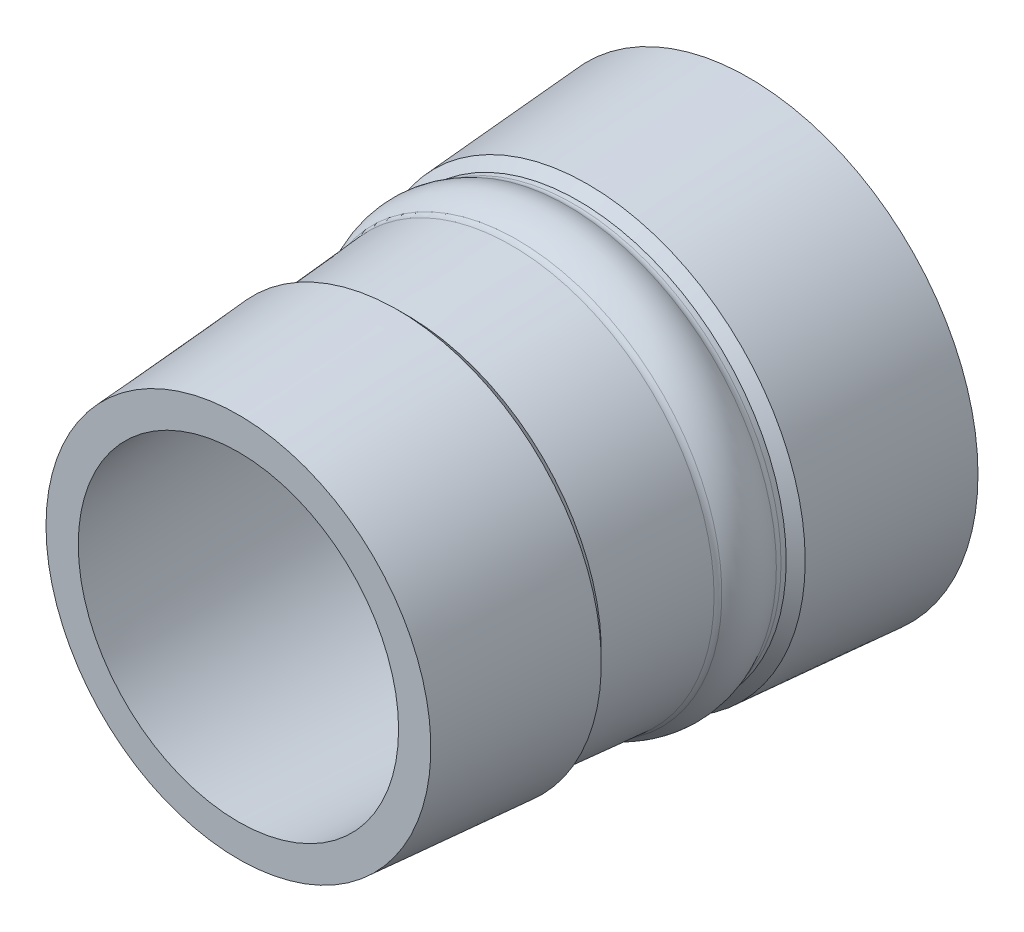
ISO-10303-21;
HEADER;
FILE_DESCRIPTION(('STEP AP214'),'2;1');
FILE_NAME('part.step','',(''),(''),'','','');
FILE_SCHEMA(('AUTOMOTIVE_DESIGN { 1 0 10303 214 1 1 1 1 }'));
ENDSEC;
DATA;
#1=APPLICATION_CONTEXT('core data for automotive mechanical design processes');
#2=APPLICATION_PROTOCOL_DEFINITION('international standard','automotive_design',2000,#1);
#3=PRODUCT_CONTEXT('',#1,'mechanical');
#4=PRODUCT('Part','Part','',(#3));
#5=PRODUCT_RELATED_PRODUCT_CATEGORY('part','',(#4));
#6=PRODUCT_DEFINITION_FORMATION('','',#4);
#7=PRODUCT_DEFINITION_CONTEXT('part definition',#1,'design');
#8=PRODUCT_DEFINITION('design','',#6,#7);
#9=PRODUCT_DEFINITION_SHAPE('','',#8);
#10=(LENGTH_UNIT() NAMED_UNIT(*) SI_UNIT(.MILLI.,.METRE.));
#11=(NAMED_UNIT(*) PLANE_ANGLE_UNIT() SI_UNIT($,.RADIAN.));
#12=(NAMED_UNIT(*) SI_UNIT($,.STERADIAN.) SOLID_ANGLE_UNIT());
#13=UNCERTAINTY_MEASURE_WITH_UNIT(LENGTH_MEASURE(1.E-05),#10,'distance_accuracy_value','');
#14=(GEOMETRIC_REPRESENTATION_CONTEXT(3) GLOBAL_UNCERTAINTY_ASSIGNED_CONTEXT((#13)) GLOBAL_UNIT_ASSIGNED_CONTEXT((#10,
#11,#12)) REPRESENTATION_CONTEXT('',''));
#15=CARTESIAN_POINT('',(0.,0.,0.));
#16=DIRECTION('',(0.,0.,1.));
#17=DIRECTION('',(1.,0.,0.));
#18=AXIS2_PLACEMENT_3D('',#15,#16,#17);
#19=CARTESIAN_POINT('',(224.138955783126,884.647735582405,21.2777495189972));
#20=DIRECTION('',(0.,0.,1.));
#21=DIRECTION('',(1.,0.,0.));
#22=AXIS2_PLACEMENT_3D('',#19,#20,#21);
#23=TOROIDAL_SURFACE('',#22,17.7795195869481,1.);
#24=CARTESIAN_POINT('',(224.138955783126,884.647735582405,21.2063532390037));
#25=DIRECTION('',(0.,0.,-1.));
#26=DIRECTION('',(-1.,0.,0.));
#27=AXIS2_PLACEMENT_3D('',#24,#25,#26);
#28=CIRCLE('',#27,16.7820715576239);
#29=CARTESIAN_POINT('',(207.356884225502,884.647735582405,21.2063532390038));
#30=VERTEX_POINT('',#29);
#31=EDGE_CURVE('E133',#30,#30,#28,.T.);
#32=ORIENTED_EDGE('',*,*,#31,.F.);
#33=EDGE_LOOP('',(#32));
#34=FACE_BOUND('',#33,.T.);
#35=CARTESIAN_POINT('',(224.138955783126,884.647735582405,20.5523804719924));
#36=DIRECTION('',(0.,0.,1.));
#37=DIRECTION('',(-1.,0.,0.));
#38=AXIS2_PLACEMENT_3D('',#35,#36,#37);
#39=CIRCLE('',#38,17.0911594009643);
#40=CARTESIAN_POINT('',(207.047796382161,884.647735582405,20.5523804719924));
#41=VERTEX_POINT('',#40);
#42=EDGE_CURVE('E132',#41,#41,#39,.T.);
#43=ORIENTED_EDGE('',*,*,#42,.F.);
#44=EDGE_LOOP('',(#43));
#45=FACE_BOUND('',#44,.T.);
#46=ADVANCED_FACE('F42',(#34,#45),#23,.T.);
#47=CARTESIAN_POINT('',(224.138955783126,884.647735582405,16.9325723414777));
#48=DIRECTION('',(0.,0.,1.));
#49=DIRECTION('',(1.,0.,0.));
#50=AXIS2_PLACEMENT_3D('',#47,#48,#49);
#51=TOROIDAL_SURFACE('',#50,18.0905427954495,1.);
#52=CARTESIAN_POINT('',(224.138955783126,884.647735582405,17.5525044813149));
#53=DIRECTION('',(0.,0.,-1.));
#54=DIRECTION('',(1.,0.,0.));
#55=AXIS2_PLACEMENT_3D('',#52,#53,#54);
#56=CIRCLE('',#55,17.3058873666164);
#57=CARTESIAN_POINT('',(241.444843149742,884.647735582405,17.5525044813149));
#58=VERTEX_POINT('',#57);
#59=EDGE_CURVE('E129',#58,#58,#56,.T.);
#60=ORIENTED_EDGE('',*,*,#59,.F.);
#61=EDGE_LOOP('',(#60));
#62=FACE_BOUND('',#61,.T.);
#63=CARTESIAN_POINT('',(224.138955783126,884.647735582405,16.8611760614839));
#64=DIRECTION('',(0.,0.,1.));
#65=DIRECTION('',(-1.,0.,0.));
#66=AXIS2_PLACEMENT_3D('',#63,#64,#65);
#67=CIRCLE('',#66,17.0930947661254);
#68=CARTESIAN_POINT('',(207.045861017,884.647735582405,16.8611760614839));
#69=VERTEX_POINT('',#68);
#70=EDGE_CURVE('E45',#69,#69,#67,.T.);
#71=ORIENTED_EDGE('',*,*,#70,.F.);
#72=EDGE_LOOP('',(#71));
#73=FACE_BOUND('',#72,.T.);
#74=ADVANCED_FACE('F164',(#62,#73),#51,.T.);
#75=CARTESIAN_POINT('',(224.138955783126,884.647735582405,22.1784700632629));
#76=DIRECTION('',(0.,0.,-1.));
#77=DIRECTION('',(-1.,0.,0.));
#78=AXIS2_PLACEMENT_3D('',#75,#76,#77);
#79=TOROIDAL_SURFACE('',#78,19.8450372019114,1.);
#80=CARTESIAN_POINT('',(224.138955783126,884.647735582405,21.5752674100011));
#81=DIRECTION('',(0.,0.,-1.));
#82=DIRECTION('',(-1.,0.,0.));
#83=AXIS2_PLACEMENT_3D('',#80,#81,#82);
#84=CIRCLE('',#83,19.0474492386759);
#85=CARTESIAN_POINT('',(205.09150654445,884.647735582405,21.5752674100011));
#86=VERTEX_POINT('',#85);
#87=EDGE_CURVE('E121',#86,#86,#84,.T.);
#88=ORIENTED_EDGE('',*,*,#87,.F.);
#89=EDGE_LOOP('',(#88));
#90=FACE_BOUND('',#89,.T.);
#91=CARTESIAN_POINT('',(224.138955783126,884.647735582405,22.0991992897073));
#92=DIRECTION('',(0.,0.,1.));
#93=DIRECTION('',(1.,0.,0.));
#94=AXIS2_PLACEMENT_3D('',#91,#92,#93);
#95=CIRCLE('',#94,18.8481840811059);
#96=CARTESIAN_POINT('',(242.987139864231,884.647735582405,22.0991992897072));
#97=VERTEX_POINT('',#96);
#98=EDGE_CURVE('E124',#97,#97,#95,.T.);
#99=ORIENTED_EDGE('',*,*,#98,.F.);
#100=EDGE_LOOP('',(#99));
#101=FACE_BOUND('',#100,.T.);
#102=ADVANCED_FACE('F114',(#90,#101),#79,.F.);
#103=CARTESIAN_POINT('',(224.138955783126,884.647735582405,16.4098870339303));
#104=DIRECTION('',(0.,0.,-1.));
#105=DIRECTION('',(-1.,0.,0.));
#106=AXIS2_PLACEMENT_3D('',#103,#104,#105);
#107=TOROIDAL_SURFACE('',#106,20.3037607886776,1.);
#108=CARTESIAN_POINT('',(224.138955783126,884.647735582405,16.3306162603746));
#109=DIRECTION('',(0.,0.,-1.));
#110=DIRECTION('',(-1.,0.,0.));
#111=AXIS2_PLACEMENT_3D('',#108,#109,#110);
#112=CIRCLE('',#111,19.3069076678722);
#113=CARTESIAN_POINT('',(204.832048115253,884.647735582405,16.3306162603746));
#114=VERTEX_POINT('',#113);
#115=EDGE_CURVE('E91',#114,#114,#112,.T.);
#116=ORIENTED_EDGE('',*,*,#115,.F.);
#117=EDGE_LOOP('',(#116));
#118=FACE_BOUND('',#117,.T.);
#119=CARTESIAN_POINT('',(224.138955783126,884.647735582405,16.8794559063593));
#120=DIRECTION('',(0.,0.,1.));
#121=DIRECTION('',(1.,0.,0.));
#122=AXIS2_PLACEMENT_3D('',#119,#120,#121);
#123=CIRCLE('',#122,19.4208649431523);
#124=CARTESIAN_POINT('',(243.559820726278,884.647735582405,16.8794559063593));
#125=VERTEX_POINT('',#124);
#126=EDGE_CURVE('E93',#125,#125,#123,.T.);
#127=ORIENTED_EDGE('',*,*,#126,.F.);
#128=EDGE_LOOP('',(#127));
#129=FACE_BOUND('',#128,.T.);
#130=ADVANCED_FACE('F110',(#118,#129),#107,.F.);
#131=CARTESIAN_POINT('',(224.138955783126,884.647735582405,47.5));
#132=DIRECTION('',(0.,0.,-1.));
#133=DIRECTION('',(-1.,0.,0.));
#134=AXIS2_PLACEMENT_3D('',#131,#132,#133);
#135=CONICAL_SURFACE('',#134,17.9,0.0714570757138935);
#136=CARTESIAN_POINT('',(224.138955783126,884.647735582405,47.5));
#137=DIRECTION('',(0.,0.,-1.));
#138=DIRECTION('',(-1.,0.,0.));
#139=AXIS2_PLACEMENT_3D('',#136,#137,#138);
#140=CIRCLE('',#139,17.9);
#141=CARTESIAN_POINT('',(206.238955783126,884.647735582405,47.5));
#142=VERTEX_POINT('',#141);
#143=EDGE_CURVE('E89',#142,#142,#140,.T.);
#144=ORIENTED_EDGE('',*,*,#143,.T.);
#145=EDGE_LOOP('',(#144));
#146=FACE_BOUND('',#145,.T.);
#147=CARTESIAN_POINT('',(224.138955783126,884.647735582405,32.7));
#148=DIRECTION('',(0.,0.,-1.));
#149=DIRECTION('',(-1.,0.,0.));
#150=AXIS2_PLACEMENT_3D('',#147,#148,#149);
#151=CIRCLE('',#150,18.9593684210527);
#152=CARTESIAN_POINT('',(205.179587362073,884.647735582405,32.7));
#153=VERTEX_POINT('',#152);
#154=EDGE_CURVE('E11',#153,#153,#151,.T.);
#155=ORIENTED_EDGE('',*,*,#154,.F.);
#156=EDGE_LOOP('',(#155));
#157=FACE_BOUND('',#156,.T.);
#158=ADVANCED_FACE('F113',(#146,#157),#135,.T.);
#159=CARTESIAN_POINT('',(224.138955783126,884.647735582405,32.7));
#160=DIRECTION('',(0.,0.,1.));
#161=DIRECTION('',(1.,0.,0.));
#162=AXIS2_PLACEMENT_3D('',#159,#160,#161);
#163=CONICAL_SURFACE('',#162,18.9593684210527,0.785398162499993);
#164=ORIENTED_EDGE('',*,*,#154,.T.);
#165=EDGE_LOOP('',(#164));
#166=FACE_BOUND('',#165,.T.);
#167=CARTESIAN_POINT('',(224.138955783126,884.647735582405,31.8161165235168));
#168=DIRECTION('',(0.,0.,-1.));
#169=DIRECTION('',(-1.,0.,0.));
#170=AXIS2_PLACEMENT_3D('',#167,#168,#169);
#171=CIRCLE('',#170,18.0754849445695);
#172=CARTESIAN_POINT('',(206.063470838556,884.647735582405,31.8161165235168));
#173=VERTEX_POINT('',#172);
#174=EDGE_CURVE('E51',#173,#173,#171,.T.);
#175=ORIENTED_EDGE('',*,*,#174,.F.);
#176=EDGE_LOOP('',(#175));
#177=FACE_BOUND('',#176,.T.);
#178=ADVANCED_FACE('F217',(#166,#177),#163,.T.);
#179=CARTESIAN_POINT('',(224.138955783126,884.647735582405,21.791757775041));
#180=DIRECTION('',(0.,0.,-1.));
#181=DIRECTION('',(-1.,0.,0.));
#182=AXIS2_PLACEMENT_3D('',#179,#180,#181);
#183=CONICAL_SURFACE('',#182,18.8726321428936,0.0793540301231868);
#184=ORIENTED_EDGE('',*,*,#174,.T.);
#185=EDGE_LOOP('',(#184));
#186=FACE_BOUND('',#185,.T.);
#187=ORIENTED_EDGE('',*,*,#98,.T.);
#188=EDGE_LOOP('',(#187));
#189=FACE_BOUND('',#188,.T.);
#190=ADVANCED_FACE('F204',(#186,#189),#183,.T.);
#191=CARTESIAN_POINT('',(224.138955783126,884.647735582405,18.9348860329974));
#192=DIRECTION('',(0.,0.,-1.));
#193=DIRECTION('',(-1.,0.,0.));
#194=AXIS2_PLACEMENT_3D('',#191,#192,#193);
#195=TOROIDAL_SURFACE('',#194,15.5561907150907,4.37727082718614);
#196=ORIENTED_EDGE('',*,*,#87,.T.);
#197=EDGE_LOOP('',(#196));
#198=FACE_BOUND('',#197,.T.);
#199=ORIENTED_EDGE('',*,*,#126,.T.);
#200=EDGE_LOOP('',(#199));
#201=FACE_BOUND('',#200,.T.);
#202=ADVANCED_FACE('F104',(#198,#201),#195,.T.);
#203=CARTESIAN_POINT('',(224.138955783126,884.647735582405,16.638057775041));
#204=DIRECTION('',(0.,0.,-1.));
#205=DIRECTION('',(-1.,0.,0.));
#206=AXIS2_PLACEMENT_3D('',#203,#204,#205);
#207=CONICAL_SURFACE('',#206,19.2824596060844,0.0793540301232149);
#208=CARTESIAN_POINT('',(224.138955783126,884.647735582405,15.8838834764832));
#209=DIRECTION('',(0.,0.,-1.));
#210=DIRECTION('',(-1.,0.,0.));
#211=AXIS2_PLACEMENT_3D('',#208,#209,#210);
#212=CIRCLE('',#211,19.3424323129905);
#213=CARTESIAN_POINT('',(204.796523470135,884.647735582405,15.8838834764832));
#214=VERTEX_POINT('',#213);
#215=EDGE_CURVE('E84',#214,#214,#212,.T.);
#216=ORIENTED_EDGE('',*,*,#215,.F.);
#217=EDGE_LOOP('',(#216));
#218=FACE_BOUND('',#217,.T.);
#219=ORIENTED_EDGE('',*,*,#115,.T.);
#220=EDGE_LOOP('',(#219));
#221=FACE_BOUND('',#220,.T.);
#222=ADVANCED_FACE('F101',(#218,#221),#207,.T.);
#223=CARTESIAN_POINT('',(224.138955783126,884.647735582405,15.));
#224=DIRECTION('',(0.,0.,-1.));
#225=DIRECTION('',(-1.,0.,0.));
#226=AXIS2_PLACEMENT_3D('',#223,#224,#225);
#227=CONICAL_SURFACE('',#226,20.2263157894737,0.78539816250001);
#228=CARTESIAN_POINT('',(224.138955783126,884.647735582405,15.));
#229=DIRECTION('',(0.,0.,-1.));
#230=DIRECTION('',(-1.,0.,0.));
#231=AXIS2_PLACEMENT_3D('',#228,#229,#230);
#232=CIRCLE('',#231,20.2263157894737);
#233=CARTESIAN_POINT('',(203.912639993652,884.647735582405,15.));
#234=VERTEX_POINT('',#233);
#235=EDGE_CURVE('E81',#234,#234,#232,.T.);
#236=ORIENTED_EDGE('',*,*,#235,.F.);
#237=EDGE_LOOP('',(#236));
#238=FACE_BOUND('',#237,.T.);
#239=ORIENTED_EDGE('',*,*,#215,.T.);
#240=EDGE_LOOP('',(#239));
#241=FACE_BOUND('',#240,.T.);
#242=ADVANCED_FACE('F97',(#238,#241),#227,.T.);
#243=CARTESIAN_POINT('',(224.138955783126,884.647735582405,15.));
#244=DIRECTION('',(0.,0.,-1.));
#245=DIRECTION('',(-1.,0.,0.));
#246=AXIS2_PLACEMENT_3D('',#243,#244,#245);
#247=CONICAL_SURFACE('',#246,20.2263157894737,0.071457075713892);
#248=ORIENTED_EDGE('',*,*,#235,.T.);
#249=EDGE_LOOP('',(#248));
#250=FACE_BOUND('',#249,.T.);
#251=CARTESIAN_POINT('',(224.138955783126,884.647735582405,0.));
#252=DIRECTION('',(0.,0.,-1.));
#253=DIRECTION('',(-1.,0.,0.));
#254=AXIS2_PLACEMENT_3D('',#251,#252,#253);
#255=CIRCLE('',#254,21.3);
#256=CARTESIAN_POINT('',(202.838955783126,884.647735582405,0.));
#257=VERTEX_POINT('',#256);
#258=EDGE_CURVE('E77',#257,#257,#255,.T.);
#259=ORIENTED_EDGE('',*,*,#258,.F.);
#260=EDGE_LOOP('',(#259));
#261=FACE_BOUND('',#260,.T.);
#262=ADVANCED_FACE('F188',(#250,#261),#247,.T.);
#263=CARTESIAN_POINT('',(202.838955783126,884.647735582405,0.));
#264=DIRECTION('',(0.,0.,1.));
#265=DIRECTION('',(1.,0.,0.));
#266=AXIS2_PLACEMENT_3D('',#263,#264,#265);
#267=PLANE('',#266);
#268=ORIENTED_EDGE('',*,*,#258,.T.);
#269=EDGE_LOOP('',(#268));
#270=FACE_BOUND('',#269,.T.);
#271=CARTESIAN_POINT('',(224.138955783126,884.647735582405,0.));
#272=DIRECTION('',(0.,0.,-1.));
#273=DIRECTION('',(-1.,0.,0.));
#274=AXIS2_PLACEMENT_3D('',#271,#272,#273);
#275=CIRCLE('',#274,18.3);
#276=CARTESIAN_POINT('',(205.838955783126,884.647735582405,0.));
#277=VERTEX_POINT('',#276);
#278=EDGE_CURVE('E82',#277,#277,#275,.T.);
#279=ORIENTED_EDGE('',*,*,#278,.F.);
#280=EDGE_LOOP('',(#279));
#281=FACE_BOUND('',#280,.T.);
#282=ADVANCED_FACE('F78',(#270,#281),#267,.F.);
#283=CARTESIAN_POINT('',(224.138955783126,884.647735582405,0.));
#284=DIRECTION('',(0.,0.,-1.));
#285=DIRECTION('',(-1.,0.,0.));
#286=AXIS2_PLACEMENT_3D('',#283,#284,#285);
#287=CONICAL_SURFACE('',#286,18.3,0.0714570757138935);
#288=ORIENTED_EDGE('',*,*,#278,.T.);
#289=EDGE_LOOP('',(#288));
#290=FACE_BOUND('',#289,.T.);
#291=ORIENTED_EDGE('',*,*,#70,.T.);
#292=EDGE_LOOP('',(#291));
#293=FACE_BOUND('',#292,.T.);
#294=ADVANCED_FACE('F159',(#290,#293),#287,.F.);
#295=CARTESIAN_POINT('',(224.138955783126,884.647735582405,18.9348860329974));
#296=DIRECTION('',(0.,0.,-1.));
#297=DIRECTION('',(-1.,0.,0.));
#298=AXIS2_PLACEMENT_3D('',#295,#296,#297);
#299=TOROIDAL_SURFACE('',#298,15.5561907150907,2.22989172983628);
#300=ORIENTED_EDGE('',*,*,#42,.T.);
#301=EDGE_LOOP('',(#300));
#302=FACE_BOUND('',#301,.T.);
#303=ORIENTED_EDGE('',*,*,#59,.T.);
#304=EDGE_LOOP('',(#303));
#305=FACE_BOUND('',#304,.T.);
#306=ADVANCED_FACE('F154',(#302,#305),#299,.F.);
#307=CARTESIAN_POINT('',(224.138955783126,884.647735582405,20.7769873819978));
#308=DIRECTION('',(0.,0.,-1.));
#309=DIRECTION('',(-1.,0.,0.));
#310=AXIS2_PLACEMENT_3D('',#307,#308,#309);
#311=CONICAL_SURFACE('',#310,16.8128051137042,0.0714570757136913);
#312=CARTESIAN_POINT('',(224.138955783126,884.647735582405,47.5));
#313=DIRECTION('',(0.,0.,-1.));
#314=DIRECTION('',(-1.,0.,0.));
#315=AXIS2_PLACEMENT_3D('',#312,#313,#314);
#316=CIRCLE('',#315,14.9);
#317=CARTESIAN_POINT('',(209.238955783126,884.647735582405,47.5));
#318=VERTEX_POINT('',#317);
#319=EDGE_CURVE('E136',#318,#318,#316,.T.);
#320=ORIENTED_EDGE('',*,*,#319,.F.);
#321=EDGE_LOOP('',(#320));
#322=FACE_BOUND('',#321,.T.);
#323=ORIENTED_EDGE('',*,*,#31,.T.);
#324=EDGE_LOOP('',(#323));
#325=FACE_BOUND('',#324,.T.);
#326=ADVANCED_FACE('F148',(#322,#325),#311,.F.);
#327=CARTESIAN_POINT('',(206.238955783126,884.647735582405,47.5));
#328=DIRECTION('',(0.,0.,1.));
#329=DIRECTION('',(1.,0.,0.));
#330=AXIS2_PLACEMENT_3D('',#327,#328,#329);
#331=PLANE('',#330);
#332=ORIENTED_EDGE('',*,*,#143,.F.);
#333=EDGE_LOOP('',(#332));
#334=FACE_BOUND('',#333,.T.);
#335=ORIENTED_EDGE('',*,*,#319,.T.);
#336=EDGE_LOOP('',(#335));
#337=FACE_BOUND('',#336,.T.);
#338=ADVANCED_FACE('F145',(#334,#337),#331,.T.);
#339=CLOSED_SHELL('',(#46,#74,#102,#130,#158,#178,#190,#202,#222,#242,#262,#282,#294,#306,#326,#338));
#340=MANIFOLD_SOLID_BREP('B2',#339);
#341=ADVANCED_BREP_SHAPE_REPRESENTATION('',(#18,#340),#14);
#342=SHAPE_DEFINITION_REPRESENTATION(#9,#341);
ENDSEC;
END-ISO-10303-21;
